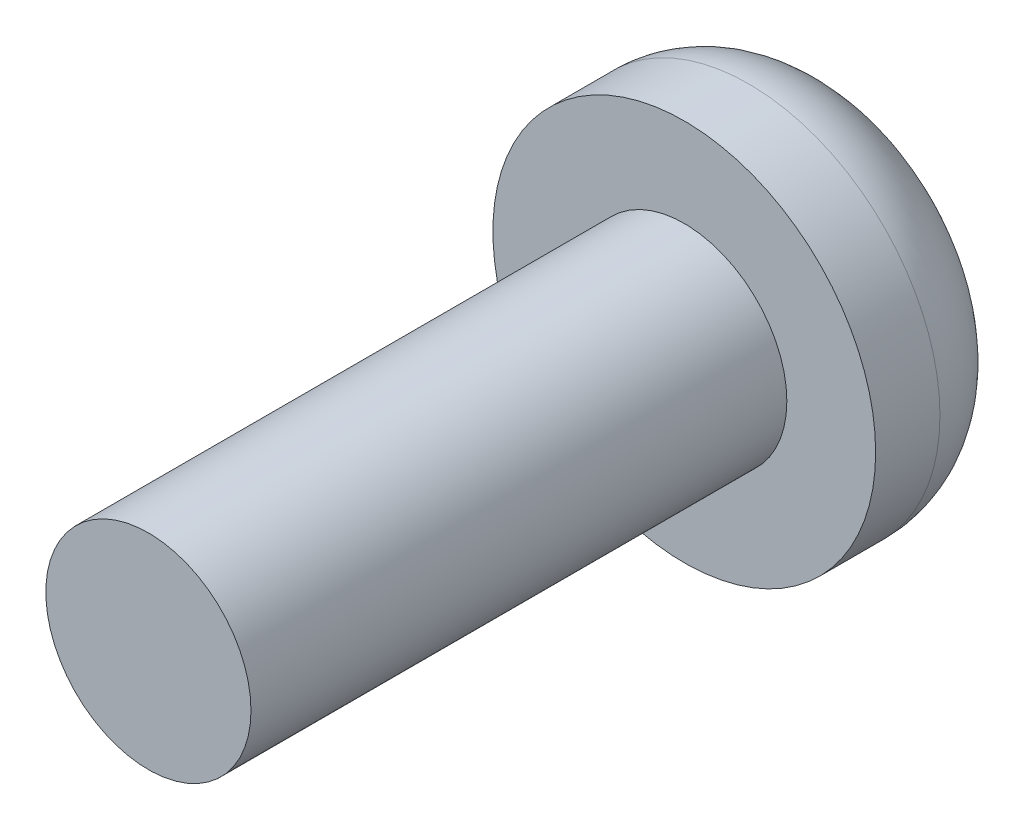
ISO-10303-21;
HEADER;
FILE_DESCRIPTION(('STEP AP214'),'2;1');
FILE_NAME('part.step','',(''),(''),'','','');
FILE_SCHEMA(('AUTOMOTIVE_DESIGN { 1 0 10303 214 1 1 1 1 }'));
ENDSEC;
DATA;
#1=APPLICATION_CONTEXT('core data for automotive mechanical design processes');
#2=APPLICATION_PROTOCOL_DEFINITION('international standard','automotive_design',2000,#1);
#3=PRODUCT_CONTEXT('',#1,'mechanical');
#4=PRODUCT('Part','Part','',(#3));
#5=PRODUCT_RELATED_PRODUCT_CATEGORY('part','',(#4));
#6=PRODUCT_DEFINITION_FORMATION('','',#4);
#7=PRODUCT_DEFINITION_CONTEXT('part definition',#1,'design');
#8=PRODUCT_DEFINITION('design','',#6,#7);
#9=PRODUCT_DEFINITION_SHAPE('','',#8);
#10=(LENGTH_UNIT() NAMED_UNIT(*) SI_UNIT(.MILLI.,.METRE.));
#11=(NAMED_UNIT(*) PLANE_ANGLE_UNIT() SI_UNIT($,.RADIAN.));
#12=(NAMED_UNIT(*) SI_UNIT($,.STERADIAN.) SOLID_ANGLE_UNIT());
#13=UNCERTAINTY_MEASURE_WITH_UNIT(LENGTH_MEASURE(1.E-05),#10,'distance_accuracy_value','');
#14=(GEOMETRIC_REPRESENTATION_CONTEXT(3) GLOBAL_UNCERTAINTY_ASSIGNED_CONTEXT((#13)) GLOBAL_UNIT_ASSIGNED_CONTEXT((#10,
#11,#12)) REPRESENTATION_CONTEXT('',''));
#15=CARTESIAN_POINT('',(0.,0.,0.));
#16=DIRECTION('',(0.,0.,1.));
#17=DIRECTION('',(1.,0.,0.));
#18=AXIS2_PLACEMENT_3D('',#15,#16,#17);
#19=CARTESIAN_POINT('',(0.,0.,0.));
#20=DIRECTION('',(0.,0.,1.));
#21=DIRECTION('',(1.,0.,0.));
#22=AXIS2_PLACEMENT_3D('',#19,#20,#21);
#23=PLANE('',#22);
#24=DIRECTION('',(1.,0.,0.));
#25=VECTOR('',#24,1.);
#26=CARTESIAN_POINT('',(-1.638189960308,0.205267274415758,0.));
#27=LINE('',#26,#25);
#28=CARTESIAN_POINT('',(0.205267274415759,0.205267274415758,0.));
#29=VERTEX_POINT('',#28);
#30=CARTESIAN_POINT('',(1.638189960308,0.205267274415758,0.));
#31=VERTEX_POINT('',#30);
#32=EDGE_CURVE('E198',#29,#31,#27,.T.);
#33=ORIENTED_EDGE('',*,*,#32,.F.);
#34=DIRECTION('',(0.,-1.,0.));
#35=VECTOR('',#34,1.);
#36=CARTESIAN_POINT('',(0.205267274415764,1.638189960308,0.));
#37=LINE('',#36,#35);
#38=CARTESIAN_POINT('',(0.205267274415764,1.638189960308,0.));
#39=VERTEX_POINT('',#38);
#40=EDGE_CURVE('E145',#39,#29,#37,.T.);
#41=ORIENTED_EDGE('',*,*,#40,.F.);
#42=CARTESIAN_POINT('',(0.,0.,0.));
#43=DIRECTION('',(0.,0.,1.));
#44=DIRECTION('',(1.,0.,0.));
#45=AXIS2_PLACEMENT_3D('',#42,#43,#44);
#46=CIRCLE('',#45,1.651);
#47=EDGE_CURVE('E40',#39,#31,#46,.F.);
#48=ORIENTED_EDGE('',*,*,#47,.T.);
#49=EDGE_LOOP('',(#33,#41,#48));
#50=FACE_BOUND('',#49,.T.);
#51=ADVANCED_FACE('F31',(#50),#23,.F.);
#52=CARTESIAN_POINT('',(-0.205267274415752,1.638189960308,0.));
#53=VERTEX_POINT('',#52);
#54=EDGE_CURVE('E230',#53,#39,#46,.F.);
#55=ORIENTED_EDGE('',*,*,#54,.T.);
#56=DIRECTION('',(1.,0.,0.));
#57=VECTOR('',#56,1.);
#58=CARTESIAN_POINT('',(0.205267274415764,1.638189960308,0.));
#59=LINE('',#58,#57);
#60=EDGE_CURVE('E156',#53,#39,#59,.T.);
#61=ORIENTED_EDGE('',*,*,#60,.F.);
#62=EDGE_LOOP('',(#55,#61));
#63=FACE_BOUND('',#62,.T.);
#64=ADVANCED_FACE('F245',(#63),#23,.F.);
#65=CARTESIAN_POINT('',(1.638189960308,-0.205267274415758,0.));
#66=VERTEX_POINT('',#65);
#67=CARTESIAN_POINT('',(0.205267274415752,-1.638189960308,0.));
#68=VERTEX_POINT('',#67);
#69=EDGE_CURVE('E11',#66,#68,#46,.F.);
#70=ORIENTED_EDGE('',*,*,#69,.T.);
#71=CARTESIAN_POINT('',(0.205267274415757,-0.205267274415758,0.));
#72=VERTEX_POINT('',#71);
#73=EDGE_CURVE('E147',#72,#68,#37,.T.);
#74=ORIENTED_EDGE('',*,*,#73,.F.);
#75=DIRECTION('',(-1.,0.,0.));
#76=VECTOR('',#75,1.);
#77=CARTESIAN_POINT('',(-1.638189960308,-0.205267274415758,0.));
#78=LINE('',#77,#76);
#79=EDGE_CURVE('E192',#66,#72,#78,.T.);
#80=ORIENTED_EDGE('',*,*,#79,.F.);
#81=EDGE_LOOP('',(#70,#74,#80));
#82=FACE_BOUND('',#81,.T.);
#83=ADVANCED_FACE('F268',(#82),#23,.F.);
#84=CARTESIAN_POINT('',(-0.205267274415764,-1.638189960308,0.));
#85=VERTEX_POINT('',#84);
#86=EDGE_CURVE('E39',#68,#85,#46,.F.);
#87=ORIENTED_EDGE('',*,*,#86,.T.);
#88=DIRECTION('',(-1.,0.,0.));
#89=VECTOR('',#88,1.);
#90=CARTESIAN_POINT('',(0.205267274415752,-1.638189960308,0.));
#91=LINE('',#90,#89);
#92=EDGE_CURVE('E128',#68,#85,#91,.T.);
#93=ORIENTED_EDGE('',*,*,#92,.F.);
#94=EDGE_LOOP('',(#87,#93));
#95=FACE_BOUND('',#94,.T.);
#96=ADVANCED_FACE('F279',(#95),#23,.F.);
#97=CARTESIAN_POINT('',(-1.638189960308,0.205267274415758,1.016));
#98=DIRECTION('',(0.,1.,0.));
#99=DIRECTION('',(-1.,0.,0.));
#100=AXIS2_PLACEMENT_3D('',#97,#98,#99);
#101=PLANE('',#100);
#102=DIRECTION('',(1.,0.,0.));
#103=VECTOR('',#102,1.);
#104=CARTESIAN_POINT('',(-1.638189960308,0.205267274415758,1.016));
#105=LINE('',#104,#103);
#106=CARTESIAN_POINT('',(0.205267274415758,0.205267274415758,1.016));
#107=VERTEX_POINT('',#106);
#108=CARTESIAN_POINT('',(1.638189960308,0.205267274415758,1.016));
#109=VERTEX_POINT('',#108);
#110=EDGE_CURVE('E186',#107,#109,#105,.T.);
#111=ORIENTED_EDGE('',*,*,#110,.F.);
#112=DIRECTION('',(0.,0.,-1.));
#113=VECTOR('',#112,1.);
#114=CARTESIAN_POINT('',(0.205267274415759,0.205267274415758,1.016));
#115=LINE('',#114,#113);
#116=EDGE_CURVE('E172',#107,#29,#115,.T.);
#117=ORIENTED_EDGE('',*,*,#116,.T.);
#118=ORIENTED_EDGE('',*,*,#32,.T.);
#119=DIRECTION('',(0.,0.,-1.));
#120=VECTOR('',#119,1.);
#121=CARTESIAN_POINT('',(1.638189960308,0.205267274415758,1.016));
#122=LINE('',#121,#120);
#123=EDGE_CURVE('E201',#109,#31,#122,.T.);
#124=ORIENTED_EDGE('',*,*,#123,.F.);
#125=EDGE_LOOP('',(#111,#117,#118,#124));
#126=FACE_BOUND('',#125,.T.);
#127=ADVANCED_FACE('F284',(#126),#101,.F.);
#128=CARTESIAN_POINT('',(-1.638189960308,-0.205267274415758,1.016));
#129=DIRECTION('',(0.,-1.,0.));
#130=DIRECTION('',(1.,0.,0.));
#131=AXIS2_PLACEMENT_3D('',#128,#129,#130);
#132=PLANE('',#131);
#133=ORIENTED_EDGE('',*,*,#79,.T.);
#134=DIRECTION('',(0.,0.,1.));
#135=VECTOR('',#134,1.);
#136=CARTESIAN_POINT('',(0.205267274415757,-0.205267274415758,1.016));
#137=LINE('',#136,#135);
#138=CARTESIAN_POINT('',(0.205267274415757,-0.205267274415758,1.016));
#139=VERTEX_POINT('',#138);
#140=EDGE_CURVE('E169',#72,#139,#137,.T.);
#141=ORIENTED_EDGE('',*,*,#140,.T.);
#142=DIRECTION('',(-1.,0.,0.));
#143=VECTOR('',#142,1.);
#144=CARTESIAN_POINT('',(-1.638189960308,-0.205267274415758,1.016));
#145=LINE('',#144,#143);
#146=CARTESIAN_POINT('',(1.638189960308,-0.205267274415758,1.016));
#147=VERTEX_POINT('',#146);
#148=EDGE_CURVE('E181',#147,#139,#145,.T.);
#149=ORIENTED_EDGE('',*,*,#148,.F.);
#150=DIRECTION('',(0.,0.,-1.));
#151=VECTOR('',#150,1.);
#152=CARTESIAN_POINT('',(1.638189960308,-0.205267274415758,1.016));
#153=LINE('',#152,#151);
#154=EDGE_CURVE('E189',#147,#66,#153,.T.);
#155=ORIENTED_EDGE('',*,*,#154,.T.);
#156=EDGE_LOOP('',(#133,#141,#149,#155));
#157=FACE_BOUND('',#156,.T.);
#158=ADVANCED_FACE('F270',(#157),#132,.F.);
#159=EDGE_CURVE('E221',#31,#66,#46,.F.);
#160=ORIENTED_EDGE('',*,*,#159,.T.);
#161=DIRECTION('',(0.,-1.,0.));
#162=VECTOR('',#161,1.);
#163=CARTESIAN_POINT('',(1.638189960308,0.205267274415758,0.));
#164=LINE('',#163,#162);
#165=EDGE_CURVE('E175',#31,#66,#164,.T.);
#166=ORIENTED_EDGE('',*,*,#165,.F.);
#167=EDGE_LOOP('',(#160,#166));
#168=FACE_BOUND('',#167,.T.);
#169=ADVANCED_FACE('F276',(#168),#23,.F.);
#170=CARTESIAN_POINT('',(-1.638189960308,0.205267274415758,0.));
#171=VERTEX_POINT('',#170);
#172=EDGE_CURVE('E225',#171,#53,#46,.F.);
#173=ORIENTED_EDGE('',*,*,#172,.T.);
#174=DIRECTION('',(0.,1.,0.));
#175=VECTOR('',#174,1.);
#176=CARTESIAN_POINT('',(-0.205267274415752,1.638189960308,0.));
#177=LINE('',#176,#175);
#178=CARTESIAN_POINT('',(-0.205267274415757,0.205267274415758,0.));
#179=VERTEX_POINT('',#178);
#180=EDGE_CURVE('E153',#179,#53,#177,.T.);
#181=ORIENTED_EDGE('',*,*,#180,.F.);
#182=EDGE_CURVE('E180',#171,#179,#27,.T.);
#183=ORIENTED_EDGE('',*,*,#182,.F.);
#184=EDGE_LOOP('',(#173,#181,#183));
#185=FACE_BOUND('',#184,.T.);
#186=ADVANCED_FACE('F254',(#185),#23,.F.);
#187=CARTESIAN_POINT('',(-1.638189960308,-0.205267274415758,0.));
#188=VERTEX_POINT('',#187);
#189=EDGE_CURVE('E41',#188,#171,#46,.F.);
#190=ORIENTED_EDGE('',*,*,#189,.T.);
#191=DIRECTION('',(0.,1.,0.));
#192=VECTOR('',#191,1.);
#193=CARTESIAN_POINT('',(-1.638189960308,0.205267274415758,0.));
#194=LINE('',#193,#192);
#195=EDGE_CURVE('E195',#188,#171,#194,.T.);
#196=ORIENTED_EDGE('',*,*,#195,.F.);
#197=EDGE_LOOP('',(#190,#196));
#198=FACE_BOUND('',#197,.T.);
#199=ADVANCED_FACE('F264',(#198),#23,.F.);
#200=CARTESIAN_POINT('',(0.,0.,2.5908));
#201=DIRECTION('',(0.,0.,1.));
#202=DIRECTION('',(1.,0.,0.));
#203=AXIS2_PLACEMENT_3D('',#200,#201,#202);
#204=PLANE('',#203);
#205=CARTESIAN_POINT('',(0.,0.,2.5908));
#206=DIRECTION('',(0.,0.,1.));
#207=DIRECTION('',(1.,0.,0.));
#208=AXIS2_PLACEMENT_3D('',#205,#206,#207);
#209=CIRCLE('',#208,3.175);
#210=CARTESIAN_POINT('',(3.175,0.,2.5908));
#211=VERTEX_POINT('',#210);
#212=EDGE_CURVE('E215',#211,#211,#209,.T.);
#213=ORIENTED_EDGE('',*,*,#212,.T.);
#214=EDGE_LOOP('',(#213));
#215=FACE_BOUND('',#214,.T.);
#216=CARTESIAN_POINT('',(0.,0.,2.5908));
#217=DIRECTION('',(0.,0.,1.));
#218=DIRECTION('',(1.,0.,0.));
#219=AXIS2_PLACEMENT_3D('',#216,#217,#218);
#220=CIRCLE('',#219,1.7018);
#221=CARTESIAN_POINT('',(1.7018,0.,2.5908));
#222=VERTEX_POINT('',#221);
#223=EDGE_CURVE('E204',#222,#222,#220,.T.);
#224=ORIENTED_EDGE('',*,*,#223,.F.);
#225=EDGE_LOOP('',(#224));
#226=FACE_BOUND('',#225,.T.);
#227=ADVANCED_FACE('F303',(#215,#226),#204,.T.);
#228=CARTESIAN_POINT('',(0.,0.,2.5908));
#229=DIRECTION('',(0.,0.,-1.));
#230=DIRECTION('',(-1.,0.,0.));
#231=AXIS2_PLACEMENT_3D('',#228,#229,#230);
#232=CYLINDRICAL_SURFACE('',#231,3.175);
#233=CARTESIAN_POINT('',(0.,0.,1.524));
#234=DIRECTION('',(0.,0.,1.));
#235=DIRECTION('',(1.,0.,0.));
#236=AXIS2_PLACEMENT_3D('',#233,#234,#235);
#237=CIRCLE('',#236,3.175);
#238=CARTESIAN_POINT('',(3.175,0.,1.524));
#239=VERTEX_POINT('',#238);
#240=EDGE_CURVE('E219',#239,#239,#237,.T.);
#241=ORIENTED_EDGE('',*,*,#240,.T.);
#242=EDGE_LOOP('',(#241));
#243=FACE_BOUND('',#242,.T.);
#244=ORIENTED_EDGE('',*,*,#212,.F.);
#245=EDGE_LOOP('',(#244));
#246=FACE_BOUND('',#245,.T.);
#247=ADVANCED_FACE('F297',(#243,#246),#232,.T.);
#248=CARTESIAN_POINT('',(-0.205267274415759,-0.205267274415758,0.));
#249=VERTEX_POINT('',#248);
#250=EDGE_CURVE('E191',#249,#188,#78,.T.);
#251=ORIENTED_EDGE('',*,*,#250,.F.);
#252=EDGE_CURVE('E154',#85,#249,#177,.T.);
#253=ORIENTED_EDGE('',*,*,#252,.F.);
#254=EDGE_CURVE('E233',#85,#188,#46,.F.);
#255=ORIENTED_EDGE('',*,*,#254,.T.);
#256=EDGE_LOOP('',(#251,#253,#255));
#257=FACE_BOUND('',#256,.T.);
#258=ADVANCED_FACE('F287',(#257),#23,.F.);
#259=CARTESIAN_POINT('',(0.,0.,1.524));
#260=DIRECTION('',(0.,0.,1.));
#261=DIRECTION('',(1.,0.,0.));
#262=AXIS2_PLACEMENT_3D('',#259,#260,#261);
#263=TOROIDAL_SURFACE('',#262,1.651,1.524);
#264=ORIENTED_EDGE('',*,*,#69,.F.);
#265=ORIENTED_EDGE('',*,*,#159,.F.);
#266=ORIENTED_EDGE('',*,*,#47,.F.);
#267=ORIENTED_EDGE('',*,*,#54,.F.);
#268=ORIENTED_EDGE('',*,*,#172,.F.);
#269=ORIENTED_EDGE('',*,*,#189,.F.);
#270=ORIENTED_EDGE('',*,*,#254,.F.);
#271=ORIENTED_EDGE('',*,*,#86,.F.);
#272=EDGE_LOOP('',(#264,#265,#266,#267,#268,#269,#270,#271));
#273=FACE_BOUND('',#272,.T.);
#274=ORIENTED_EDGE('',*,*,#240,.F.);
#275=EDGE_LOOP('',(#274));
#276=FACE_BOUND('',#275,.T.);
#277=ADVANCED_FACE('F33',(#273,#276),#263,.T.);
#278=CARTESIAN_POINT('',(0.,0.,11.4808));
#279=DIRECTION('',(0.,0.,-1.));
#280=DIRECTION('',(-1.,0.,0.));
#281=AXIS2_PLACEMENT_3D('',#278,#279,#280);
#282=CYLINDRICAL_SURFACE('',#281,1.7018);
#283=CARTESIAN_POINT('',(0.,0.,11.4808));
#284=DIRECTION('',(0.,0.,1.));
#285=DIRECTION('',(1.,0.,0.));
#286=AXIS2_PLACEMENT_3D('',#283,#284,#285);
#287=CIRCLE('',#286,1.7018);
#288=CARTESIAN_POINT('',(1.7018,0.,11.4808));
#289=VERTEX_POINT('',#288);
#290=EDGE_CURVE('E212',#289,#289,#287,.T.);
#291=ORIENTED_EDGE('',*,*,#290,.F.);
#292=EDGE_LOOP('',(#291));
#293=FACE_BOUND('',#292,.T.);
#294=ORIENTED_EDGE('',*,*,#223,.T.);
#295=EDGE_LOOP('',(#294));
#296=FACE_BOUND('',#295,.T.);
#297=ADVANCED_FACE('F302',(#293,#296),#282,.T.);
#298=CARTESIAN_POINT('',(0.,0.,11.4808));
#299=DIRECTION('',(0.,0.,1.));
#300=DIRECTION('',(1.,0.,0.));
#301=AXIS2_PLACEMENT_3D('',#298,#299,#300);
#302=PLANE('',#301);
#303=ORIENTED_EDGE('',*,*,#290,.T.);
#304=EDGE_LOOP('',(#303));
#305=FACE_BOUND('',#304,.T.);
#306=ADVANCED_FACE('F315',(#305),#302,.T.);
#307=CARTESIAN_POINT('',(1.638189960308,0.205267274415758,1.016));
#308=DIRECTION('',(1.,0.,0.));
#309=DIRECTION('',(0.,0.,-1.));
#310=AXIS2_PLACEMENT_3D('',#307,#308,#309);
#311=PLANE('',#310);
#312=ORIENTED_EDGE('',*,*,#165,.T.);
#313=ORIENTED_EDGE('',*,*,#154,.F.);
#314=DIRECTION('',(0.,-1.,0.));
#315=VECTOR('',#314,1.);
#316=CARTESIAN_POINT('',(1.638189960308,0.205267274415758,1.016));
#317=LINE('',#316,#315);
#318=EDGE_CURVE('E176',#109,#147,#317,.T.);
#319=ORIENTED_EDGE('',*,*,#318,.F.);
#320=ORIENTED_EDGE('',*,*,#123,.T.);
#321=EDGE_LOOP('',(#312,#313,#319,#320));
#322=FACE_BOUND('',#321,.T.);
#323=ADVANCED_FACE('F274',(#322),#311,.F.);
#324=ORIENTED_EDGE('',*,*,#182,.T.);
#325=DIRECTION('',(0.,0.,1.));
#326=VECTOR('',#325,1.);
#327=CARTESIAN_POINT('',(-0.205267274415757,0.205267274415758,1.016));
#328=LINE('',#327,#326);
#329=CARTESIAN_POINT('',(-0.205267274415757,0.205267274415758,1.016));
#330=VERTEX_POINT('',#329);
#331=EDGE_CURVE('E166',#179,#330,#328,.T.);
#332=ORIENTED_EDGE('',*,*,#331,.T.);
#333=CARTESIAN_POINT('',(-1.638189960308,0.205267274415758,1.016));
#334=VERTEX_POINT('',#333);
#335=EDGE_CURVE('E187',#334,#330,#105,.T.);
#336=ORIENTED_EDGE('',*,*,#335,.F.);
#337=DIRECTION('',(0.,0.,-1.));
#338=VECTOR('',#337,1.);
#339=CARTESIAN_POINT('',(-1.638189960308,0.205267274415758,1.016));
#340=LINE('',#339,#338);
#341=EDGE_CURVE('E205',#334,#171,#340,.T.);
#342=ORIENTED_EDGE('',*,*,#341,.T.);
#343=EDGE_LOOP('',(#324,#332,#336,#342));
#344=FACE_BOUND('',#343,.T.);
#345=ADVANCED_FACE('F256',(#344),#101,.F.);
#346=CARTESIAN_POINT('',(-1.638189960308,0.205267274415758,1.016));
#347=DIRECTION('',(-1.,0.,0.));
#348=DIRECTION('',(0.,0.,1.));
#349=AXIS2_PLACEMENT_3D('',#346,#347,#348);
#350=PLANE('',#349);
#351=ORIENTED_EDGE('',*,*,#195,.T.);
#352=ORIENTED_EDGE('',*,*,#341,.F.);
#353=DIRECTION('',(0.,1.,0.));
#354=VECTOR('',#353,1.);
#355=CARTESIAN_POINT('',(-1.638189960308,0.205267274415758,1.016));
#356=LINE('',#355,#354);
#357=CARTESIAN_POINT('',(-1.638189960308,-0.205267274415758,1.016));
#358=VERTEX_POINT('',#357);
#359=EDGE_CURVE('E183',#358,#334,#356,.T.);
#360=ORIENTED_EDGE('',*,*,#359,.F.);
#361=DIRECTION('',(0.,0.,-1.));
#362=VECTOR('',#361,1.);
#363=CARTESIAN_POINT('',(-1.638189960308,-0.205267274415758,1.016));
#364=LINE('',#363,#362);
#365=EDGE_CURVE('E207',#358,#188,#364,.T.);
#366=ORIENTED_EDGE('',*,*,#365,.T.);
#367=EDGE_LOOP('',(#351,#352,#360,#366));
#368=FACE_BOUND('',#367,.T.);
#369=ADVANCED_FACE('F261',(#368),#350,.F.);
#370=CARTESIAN_POINT('',(-0.205267274415758,-0.205267274415758,1.016));
#371=VERTEX_POINT('',#370);
#372=EDGE_CURVE('E179',#371,#358,#145,.T.);
#373=ORIENTED_EDGE('',*,*,#372,.F.);
#374=DIRECTION('',(0.,0.,-1.));
#375=VECTOR('',#374,1.);
#376=CARTESIAN_POINT('',(-0.205267274415759,-0.205267274415758,1.016));
#377=LINE('',#376,#375);
#378=EDGE_CURVE('E135',#371,#249,#377,.T.);
#379=ORIENTED_EDGE('',*,*,#378,.T.);
#380=ORIENTED_EDGE('',*,*,#250,.T.);
#381=ORIENTED_EDGE('',*,*,#365,.F.);
#382=EDGE_LOOP('',(#373,#379,#380,#381));
#383=FACE_BOUND('',#382,.T.);
#384=ADVANCED_FACE('F286',(#383),#132,.F.);
#385=CARTESIAN_POINT('',(1.638189960308,-0.205267274415758,1.016));
#386=DIRECTION('',(0.,0.,1.));
#387=DIRECTION('',(1.,0.,0.));
#388=AXIS2_PLACEMENT_3D('',#385,#386,#387);
#389=PLANE('',#388);
#390=ORIENTED_EDGE('',*,*,#335,.T.);
#391=DIRECTION('',(0.,1.,0.));
#392=VECTOR('',#391,1.);
#393=CARTESIAN_POINT('',(-0.205267274415752,1.638189960308,1.016));
#394=LINE('',#393,#392);
#395=CARTESIAN_POINT('',(-0.205267274415752,1.638189960308,1.016));
#396=VERTEX_POINT('',#395);
#397=EDGE_CURVE('E138',#330,#396,#394,.T.);
#398=ORIENTED_EDGE('',*,*,#397,.T.);
#399=DIRECTION('',(1.,0.,0.));
#400=VECTOR('',#399,1.);
#401=CARTESIAN_POINT('',(0.205267274415764,1.638189960308,1.016));
#402=LINE('',#401,#400);
#403=CARTESIAN_POINT('',(0.205267274415764,1.638189960308,1.016));
#404=VERTEX_POINT('',#403);
#405=EDGE_CURVE('E137',#396,#404,#402,.T.);
#406=ORIENTED_EDGE('',*,*,#405,.T.);
#407=DIRECTION('',(0.,-1.,0.));
#408=VECTOR('',#407,1.);
#409=CARTESIAN_POINT('',(0.205267274415764,1.638189960308,1.016));
#410=LINE('',#409,#408);
#411=EDGE_CURVE('E48',#404,#107,#410,.T.);
#412=ORIENTED_EDGE('',*,*,#411,.T.);
#413=ORIENTED_EDGE('',*,*,#110,.T.);
#414=ORIENTED_EDGE('',*,*,#318,.T.);
#415=ORIENTED_EDGE('',*,*,#148,.T.);
#416=CARTESIAN_POINT('',(0.205267274415752,-1.638189960308,1.016));
#417=VERTEX_POINT('',#416);
#418=EDGE_CURVE('E143',#139,#417,#410,.T.);
#419=ORIENTED_EDGE('',*,*,#418,.T.);
#420=DIRECTION('',(-1.,0.,0.));
#421=VECTOR('',#420,1.);
#422=CARTESIAN_POINT('',(0.205267274415752,-1.638189960308,1.016));
#423=LINE('',#422,#421);
#424=CARTESIAN_POINT('',(-0.205267274415764,-1.638189960308,1.016));
#425=VERTEX_POINT('',#424);
#426=EDGE_CURVE('E126',#417,#425,#423,.T.);
#427=ORIENTED_EDGE('',*,*,#426,.T.);
#428=EDGE_CURVE('E55',#425,#371,#394,.T.);
#429=ORIENTED_EDGE('',*,*,#428,.T.);
#430=ORIENTED_EDGE('',*,*,#372,.T.);
#431=ORIENTED_EDGE('',*,*,#359,.T.);
#432=EDGE_LOOP('',(#390,#398,#406,#412,#413,#414,#415,#419,#427,#429,#430,#431));
#433=FACE_BOUND('',#432,.T.);
#434=ADVANCED_FACE('F141',(#433),#389,.F.);
#435=CARTESIAN_POINT('',(-0.205267274415752,1.638189960308,1.016));
#436=DIRECTION('',(-1.,0.,0.));
#437=DIRECTION('',(0.,-1.,0.));
#438=AXIS2_PLACEMENT_3D('',#435,#436,#437);
#439=PLANE('',#438);
#440=ORIENTED_EDGE('',*,*,#428,.F.);
#441=DIRECTION('',(0.,0.,-1.));
#442=VECTOR('',#441,1.);
#443=CARTESIAN_POINT('',(-0.205267274415764,-1.638189960308,1.016));
#444=LINE('',#443,#442);
#445=EDGE_CURVE('E123',#425,#85,#444,.T.);
#446=ORIENTED_EDGE('',*,*,#445,.T.);
#447=ORIENTED_EDGE('',*,*,#252,.T.);
#448=ORIENTED_EDGE('',*,*,#378,.F.);
#449=EDGE_LOOP('',(#440,#446,#447,#448));
#450=FACE_BOUND('',#449,.T.);
#451=ADVANCED_FACE('F133',(#450),#439,.F.);
#452=CARTESIAN_POINT('',(0.205267274415764,1.638189960308,1.016));
#453=DIRECTION('',(1.,0.,0.));
#454=DIRECTION('',(0.,1.,0.));
#455=AXIS2_PLACEMENT_3D('',#452,#453,#454);
#456=PLANE('',#455);
#457=ORIENTED_EDGE('',*,*,#73,.T.);
#458=DIRECTION('',(0.,0.,-1.));
#459=VECTOR('',#458,1.);
#460=CARTESIAN_POINT('',(0.205267274415752,-1.638189960308,1.016));
#461=LINE('',#460,#459);
#462=EDGE_CURVE('E159',#417,#68,#461,.T.);
#463=ORIENTED_EDGE('',*,*,#462,.F.);
#464=ORIENTED_EDGE('',*,*,#418,.F.);
#465=ORIENTED_EDGE('',*,*,#140,.F.);
#466=EDGE_LOOP('',(#457,#463,#464,#465));
#467=FACE_BOUND('',#466,.T.);
#468=ADVANCED_FACE('F333',(#467),#456,.F.);
#469=CARTESIAN_POINT('',(0.205267274415752,-1.638189960308,1.016));
#470=DIRECTION('',(0.,-1.,0.));
#471=DIRECTION('',(1.,0.,0.));
#472=AXIS2_PLACEMENT_3D('',#469,#470,#471);
#473=PLANE('',#472);
#474=ORIENTED_EDGE('',*,*,#92,.T.);
#475=ORIENTED_EDGE('',*,*,#445,.F.);
#476=ORIENTED_EDGE('',*,*,#426,.F.);
#477=ORIENTED_EDGE('',*,*,#462,.T.);
#478=EDGE_LOOP('',(#474,#475,#476,#477));
#479=FACE_BOUND('',#478,.T.);
#480=ADVANCED_FACE('F124',(#479),#473,.F.);
#481=ORIENTED_EDGE('',*,*,#411,.F.);
#482=DIRECTION('',(0.,0.,-1.));
#483=VECTOR('',#482,1.);
#484=CARTESIAN_POINT('',(0.205267274415764,1.638189960308,1.016));
#485=LINE('',#484,#483);
#486=EDGE_CURVE('E161',#404,#39,#485,.T.);
#487=ORIENTED_EDGE('',*,*,#486,.T.);
#488=ORIENTED_EDGE('',*,*,#40,.T.);
#489=ORIENTED_EDGE('',*,*,#116,.F.);
#490=EDGE_LOOP('',(#481,#487,#488,#489));
#491=FACE_BOUND('',#490,.T.);
#492=ADVANCED_FACE('F332',(#491),#456,.F.);
#493=ORIENTED_EDGE('',*,*,#180,.T.);
#494=DIRECTION('',(0.,0.,-1.));
#495=VECTOR('',#494,1.);
#496=CARTESIAN_POINT('',(-0.205267274415752,1.638189960308,1.016));
#497=LINE('',#496,#495);
#498=EDGE_CURVE('E131',#396,#53,#497,.T.);
#499=ORIENTED_EDGE('',*,*,#498,.F.);
#500=ORIENTED_EDGE('',*,*,#397,.F.);
#501=ORIENTED_EDGE('',*,*,#331,.F.);
#502=EDGE_LOOP('',(#493,#499,#500,#501));
#503=FACE_BOUND('',#502,.T.);
#504=ADVANCED_FACE('F334',(#503),#439,.F.);
#505=CARTESIAN_POINT('',(0.205267274415764,1.638189960308,1.016));
#506=DIRECTION('',(0.,1.,0.));
#507=DIRECTION('',(-1.,0.,0.));
#508=AXIS2_PLACEMENT_3D('',#505,#506,#507);
#509=PLANE('',#508);
#510=ORIENTED_EDGE('',*,*,#60,.T.);
#511=ORIENTED_EDGE('',*,*,#486,.F.);
#512=ORIENTED_EDGE('',*,*,#405,.F.);
#513=ORIENTED_EDGE('',*,*,#498,.T.);
#514=EDGE_LOOP('',(#510,#511,#512,#513));
#515=FACE_BOUND('',#514,.T.);
#516=ADVANCED_FACE('F337',(#515),#509,.F.);
#517=CLOSED_SHELL('',(#51,#64,#83,#96,#127,#158,#169,#186,#199,#227,#247,#258,#277,#297,#306,
#323,#345,#369,#384,#434,#451,#468,#480,#492,#504,#516));
#518=MANIFOLD_SOLID_BREP('B2',#517);
#519=ADVANCED_BREP_SHAPE_REPRESENTATION('',(#18,#518),#14);
#520=SHAPE_DEFINITION_REPRESENTATION(#9,#519);
ENDSEC;
END-ISO-10303-21;
